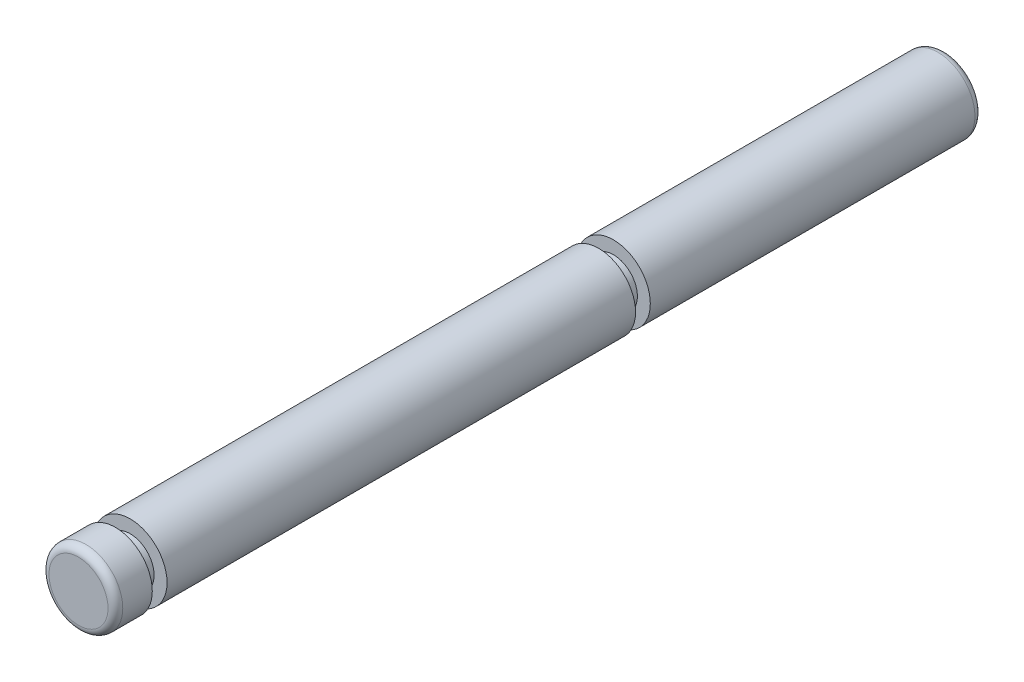
ISO-10303-21;
HEADER;
FILE_DESCRIPTION(('STEP AP214'),'2;1');
FILE_NAME('part.step','',(''),(''),'','','');
FILE_SCHEMA(('AUTOMOTIVE_DESIGN { 1 0 10303 214 1 1 1 1 }'));
ENDSEC;
DATA;
#1=APPLICATION_CONTEXT('core data for automotive mechanical design processes');
#2=APPLICATION_PROTOCOL_DEFINITION('international standard','automotive_design',2000,#1);
#3=PRODUCT_CONTEXT('',#1,'mechanical');
#4=PRODUCT('Part','Part','',(#3));
#5=PRODUCT_RELATED_PRODUCT_CATEGORY('part','',(#4));
#6=PRODUCT_DEFINITION_FORMATION('','',#4);
#7=PRODUCT_DEFINITION_CONTEXT('part definition',#1,'design');
#8=PRODUCT_DEFINITION('design','',#6,#7);
#9=PRODUCT_DEFINITION_SHAPE('','',#8);
#10=(LENGTH_UNIT() NAMED_UNIT(*) SI_UNIT(.MILLI.,.METRE.));
#11=(NAMED_UNIT(*) PLANE_ANGLE_UNIT() SI_UNIT($,.RADIAN.));
#12=(NAMED_UNIT(*) SI_UNIT($,.STERADIAN.) SOLID_ANGLE_UNIT());
#13=UNCERTAINTY_MEASURE_WITH_UNIT(LENGTH_MEASURE(1.E-05),#10,'distance_accuracy_value','');
#14=(GEOMETRIC_REPRESENTATION_CONTEXT(3) GLOBAL_UNCERTAINTY_ASSIGNED_CONTEXT((#13)) GLOBAL_UNIT_ASSIGNED_CONTEXT((#10,
#11,#12)) REPRESENTATION_CONTEXT('',''));
#15=CARTESIAN_POINT('',(0.,0.,0.));
#16=DIRECTION('',(0.,0.,1.));
#17=DIRECTION('',(1.,0.,0.));
#18=AXIS2_PLACEMENT_3D('',#15,#16,#17);
#19=CARTESIAN_POINT('',(0.,0.,0.));
#20=DIRECTION('',(0.,0.,1.));
#21=DIRECTION('',(1.,0.,0.));
#22=AXIS2_PLACEMENT_3D('',#19,#20,#21);
#23=PLANE('',#22);
#24=CARTESIAN_POINT('',(0.,0.,0.));
#25=DIRECTION('',(0.,0.,1.));
#26=DIRECTION('',(1.,0.,0.));
#27=AXIS2_PLACEMENT_3D('',#24,#25,#26);
#28=CIRCLE('',#27,0.8);
#29=CARTESIAN_POINT('',(0.8,0.,0.));
#30=VERTEX_POINT('',#29);
#31=EDGE_CURVE('E10',#30,#30,#28,.T.);
#32=ORIENTED_EDGE('',*,*,#31,.F.);
#33=EDGE_LOOP('',(#32));
#34=FACE_BOUND('',#33,.T.);
#35=ADVANCED_FACE('F30',(#34),#23,.F.);
#36=CARTESIAN_POINT('',(0.,0.,0.2));
#37=DIRECTION('',(0.,0.,1.));
#38=DIRECTION('',(1.,0.,0.));
#39=AXIS2_PLACEMENT_3D('',#36,#37,#38);
#40=TOROIDAL_SURFACE('',#39,0.8,0.2);
#41=CARTESIAN_POINT('',(0.,0.,0.199999999999999));
#42=DIRECTION('',(0.,0.,1.));
#43=DIRECTION('',(1.,0.,0.));
#44=AXIS2_PLACEMENT_3D('',#41,#42,#43);
#45=CIRCLE('',#44,1.);
#46=CARTESIAN_POINT('',(1.,0.,0.199999999999999));
#47=VERTEX_POINT('',#46);
#48=EDGE_CURVE('E36',#47,#47,#45,.T.);
#49=ORIENTED_EDGE('',*,*,#48,.F.);
#50=EDGE_LOOP('',(#49));
#51=FACE_BOUND('',#50,.T.);
#52=ORIENTED_EDGE('',*,*,#31,.T.);
#53=EDGE_LOOP('',(#52));
#54=FACE_BOUND('',#53,.T.);
#55=ADVANCED_FACE('F132',(#51,#54),#40,.T.);
#56=CARTESIAN_POINT('',(0.,0.,23.5));
#57=DIRECTION('',(0.,0.,1.));
#58=DIRECTION('',(1.,0.,0.));
#59=AXIS2_PLACEMENT_3D('',#56,#57,#58);
#60=CYLINDRICAL_SURFACE('',#59,1.);
#61=CARTESIAN_POINT('',(0.,0.,9.));
#62=DIRECTION('',(0.,0.,1.));
#63=DIRECTION('',(1.,0.,0.));
#64=AXIS2_PLACEMENT_3D('',#61,#62,#63);
#65=CIRCLE('',#64,0.999999999999999);
#66=CARTESIAN_POINT('',(0.999999999999999,0.,9.));
#67=VERTEX_POINT('',#66);
#68=EDGE_CURVE('E40',#67,#67,#65,.T.);
#69=ORIENTED_EDGE('',*,*,#68,.F.);
#70=EDGE_LOOP('',(#69));
#71=FACE_BOUND('',#70,.T.);
#72=ORIENTED_EDGE('',*,*,#48,.T.);
#73=EDGE_LOOP('',(#72));
#74=FACE_BOUND('',#73,.T.);
#75=ADVANCED_FACE('F127',(#71,#74),#60,.T.);
#76=CARTESIAN_POINT('',(0.,0.65,9.));
#77=DIRECTION('',(0.,0.,-1.));
#78=DIRECTION('',(-1.,0.,0.));
#79=AXIS2_PLACEMENT_3D('',#76,#77,#78);
#80=PLANE('',#79);
#81=CARTESIAN_POINT('',(0.,0.,9.));
#82=DIRECTION('',(0.,0.,1.));
#83=DIRECTION('',(1.,0.,0.));
#84=AXIS2_PLACEMENT_3D('',#81,#82,#83);
#85=CIRCLE('',#84,0.65);
#86=CARTESIAN_POINT('',(0.65,0.,9.));
#87=VERTEX_POINT('',#86);
#88=EDGE_CURVE('E44',#87,#87,#85,.T.);
#89=ORIENTED_EDGE('',*,*,#88,.F.);
#90=EDGE_LOOP('',(#89));
#91=FACE_BOUND('',#90,.T.);
#92=ORIENTED_EDGE('',*,*,#68,.T.);
#93=EDGE_LOOP('',(#92));
#94=FACE_BOUND('',#93,.T.);
#95=ADVANCED_FACE('F121',(#91,#94),#80,.F.);
#96=CARTESIAN_POINT('',(0.,0.,23.5));
#97=DIRECTION('',(0.,0.,1.));
#98=DIRECTION('',(1.,0.,0.));
#99=AXIS2_PLACEMENT_3D('',#96,#97,#98);
#100=CYLINDRICAL_SURFACE('',#99,0.65);
#101=CARTESIAN_POINT('',(0.,0.,9.4));
#102=DIRECTION('',(0.,0.,1.));
#103=DIRECTION('',(1.,0.,0.));
#104=AXIS2_PLACEMENT_3D('',#101,#102,#103);
#105=CIRCLE('',#104,0.65);
#106=CARTESIAN_POINT('',(0.65,0.,9.4));
#107=VERTEX_POINT('',#106);
#108=EDGE_CURVE('E49',#107,#107,#105,.T.);
#109=ORIENTED_EDGE('',*,*,#108,.F.);
#110=EDGE_LOOP('',(#109));
#111=FACE_BOUND('',#110,.T.);
#112=ORIENTED_EDGE('',*,*,#88,.T.);
#113=EDGE_LOOP('',(#112));
#114=FACE_BOUND('',#113,.T.);
#115=ADVANCED_FACE('F115',(#111,#114),#100,.T.);
#116=CARTESIAN_POINT('',(0.,0.999999999999999,9.4));
#117=DIRECTION('',(0.,0.,1.));
#118=DIRECTION('',(1.,0.,0.));
#119=AXIS2_PLACEMENT_3D('',#116,#117,#118);
#120=PLANE('',#119);
#121=CARTESIAN_POINT('',(0.,0.,9.4));
#122=DIRECTION('',(0.,0.,1.));
#123=DIRECTION('',(1.,0.,0.));
#124=AXIS2_PLACEMENT_3D('',#121,#122,#123);
#125=CIRCLE('',#124,0.999999999999999);
#126=CARTESIAN_POINT('',(0.999999999999999,0.,9.4));
#127=VERTEX_POINT('',#126);
#128=EDGE_CURVE('E52',#127,#127,#125,.T.);
#129=ORIENTED_EDGE('',*,*,#128,.F.);
#130=EDGE_LOOP('',(#129));
#131=FACE_BOUND('',#130,.T.);
#132=ORIENTED_EDGE('',*,*,#108,.T.);
#133=EDGE_LOOP('',(#132));
#134=FACE_BOUND('',#133,.T.);
#135=ADVANCED_FACE('F109',(#131,#134),#120,.F.);
#136=CARTESIAN_POINT('',(0.,0.,23.5));
#137=DIRECTION('',(0.,0.,1.));
#138=DIRECTION('',(1.,0.,0.));
#139=AXIS2_PLACEMENT_3D('',#136,#137,#138);
#140=CYLINDRICAL_SURFACE('',#139,0.999999999999998);
#141=CARTESIAN_POINT('',(0.,0.,22.1));
#142=DIRECTION('',(0.,0.,1.));
#143=DIRECTION('',(1.,0.,0.));
#144=AXIS2_PLACEMENT_3D('',#141,#142,#143);
#145=CIRCLE('',#144,0.999999999999997);
#146=CARTESIAN_POINT('',(0.999999999999997,0.,22.1));
#147=VERTEX_POINT('',#146);
#148=EDGE_CURVE('E55',#147,#147,#145,.T.);
#149=ORIENTED_EDGE('',*,*,#148,.F.);
#150=EDGE_LOOP('',(#149));
#151=FACE_BOUND('',#150,.T.);
#152=ORIENTED_EDGE('',*,*,#128,.T.);
#153=EDGE_LOOP('',(#152));
#154=FACE_BOUND('',#153,.T.);
#155=ADVANCED_FACE('F103',(#151,#154),#140,.T.);
#156=CARTESIAN_POINT('',(0.,0.999999999999997,22.1));
#157=DIRECTION('',(0.,0.,-1.));
#158=DIRECTION('',(-1.,0.,0.));
#159=AXIS2_PLACEMENT_3D('',#156,#157,#158);
#160=PLANE('',#159);
#161=CARTESIAN_POINT('',(0.,0.,22.1));
#162=DIRECTION('',(0.,0.,1.));
#163=DIRECTION('',(1.,0.,0.));
#164=AXIS2_PLACEMENT_3D('',#161,#162,#163);
#165=CIRCLE('',#164,0.65);
#166=CARTESIAN_POINT('',(0.65,0.,22.1));
#167=VERTEX_POINT('',#166);
#168=EDGE_CURVE('E58',#167,#167,#165,.T.);
#169=ORIENTED_EDGE('',*,*,#168,.F.);
#170=EDGE_LOOP('',(#169));
#171=FACE_BOUND('',#170,.T.);
#172=ORIENTED_EDGE('',*,*,#148,.T.);
#173=EDGE_LOOP('',(#172));
#174=FACE_BOUND('',#173,.T.);
#175=ADVANCED_FACE('F97',(#171,#174),#160,.F.);
#176=CARTESIAN_POINT('',(0.,0.,23.5));
#177=DIRECTION('',(0.,0.,1.));
#178=DIRECTION('',(1.,0.,0.));
#179=AXIS2_PLACEMENT_3D('',#176,#177,#178);
#180=CYLINDRICAL_SURFACE('',#179,0.65);
#181=CARTESIAN_POINT('',(0.,0.,22.5));
#182=DIRECTION('',(0.,0.,1.));
#183=DIRECTION('',(1.,0.,0.));
#184=AXIS2_PLACEMENT_3D('',#181,#182,#183);
#185=CIRCLE('',#184,0.65);
#186=CARTESIAN_POINT('',(0.65,0.,22.5));
#187=VERTEX_POINT('',#186);
#188=EDGE_CURVE('E61',#187,#187,#185,.T.);
#189=ORIENTED_EDGE('',*,*,#188,.F.);
#190=EDGE_LOOP('',(#189));
#191=FACE_BOUND('',#190,.T.);
#192=ORIENTED_EDGE('',*,*,#168,.T.);
#193=EDGE_LOOP('',(#192));
#194=FACE_BOUND('',#193,.T.);
#195=ADVANCED_FACE('F91',(#191,#194),#180,.T.);
#196=CARTESIAN_POINT('',(0.,0.999999999999997,22.5));
#197=DIRECTION('',(0.,0.,1.));
#198=DIRECTION('',(1.,0.,0.));
#199=AXIS2_PLACEMENT_3D('',#196,#197,#198);
#200=PLANE('',#199);
#201=CARTESIAN_POINT('',(0.,0.,22.5));
#202=DIRECTION('',(0.,0.,1.));
#203=DIRECTION('',(1.,0.,0.));
#204=AXIS2_PLACEMENT_3D('',#201,#202,#203);
#205=CIRCLE('',#204,0.999999999999997);
#206=CARTESIAN_POINT('',(0.999999999999997,0.,22.5));
#207=VERTEX_POINT('',#206);
#208=EDGE_CURVE('E64',#207,#207,#205,.T.);
#209=ORIENTED_EDGE('',*,*,#208,.F.);
#210=EDGE_LOOP('',(#209));
#211=FACE_BOUND('',#210,.T.);
#212=ORIENTED_EDGE('',*,*,#188,.T.);
#213=EDGE_LOOP('',(#212));
#214=FACE_BOUND('',#213,.T.);
#215=ADVANCED_FACE('F85',(#211,#214),#200,.F.);
#216=CARTESIAN_POINT('',(0.,0.,23.5));
#217=DIRECTION('',(0.,0.,1.));
#218=DIRECTION('',(1.,0.,0.));
#219=AXIS2_PLACEMENT_3D('',#216,#217,#218);
#220=CYLINDRICAL_SURFACE('',#219,0.999999999999997);
#221=CARTESIAN_POINT('',(0.,0.,23.3));
#222=DIRECTION('',(0.,0.,1.));
#223=DIRECTION('',(1.,0.,0.));
#224=AXIS2_PLACEMENT_3D('',#221,#222,#223);
#225=CIRCLE('',#224,0.999999999999997);
#226=CARTESIAN_POINT('',(0.999999999999997,0.,23.3));
#227=VERTEX_POINT('',#226);
#228=EDGE_CURVE('E67',#227,#227,#225,.T.);
#229=ORIENTED_EDGE('',*,*,#228,.F.);
#230=EDGE_LOOP('',(#229));
#231=FACE_BOUND('',#230,.T.);
#232=ORIENTED_EDGE('',*,*,#208,.T.);
#233=EDGE_LOOP('',(#232));
#234=FACE_BOUND('',#233,.T.);
#235=ADVANCED_FACE('F79',(#231,#234),#220,.T.);
#236=CARTESIAN_POINT('',(0.,0.,23.3));
#237=DIRECTION('',(0.,0.,1.));
#238=DIRECTION('',(1.,0.,0.));
#239=AXIS2_PLACEMENT_3D('',#236,#237,#238);
#240=TOROIDAL_SURFACE('',#239,0.799999999999997,0.199999999999999);
#241=CARTESIAN_POINT('',(0.,0.,23.5));
#242=DIRECTION('',(0.,0.,1.));
#243=DIRECTION('',(1.,0.,0.));
#244=AXIS2_PLACEMENT_3D('',#241,#242,#243);
#245=CIRCLE('',#244,0.799999999999997);
#246=CARTESIAN_POINT('',(0.799999999999997,0.,23.5));
#247=VERTEX_POINT('',#246);
#248=EDGE_CURVE('E70',#247,#247,#245,.T.);
#249=ORIENTED_EDGE('',*,*,#248,.F.);
#250=EDGE_LOOP('',(#249));
#251=FACE_BOUND('',#250,.T.);
#252=ORIENTED_EDGE('',*,*,#228,.T.);
#253=EDGE_LOOP('',(#252));
#254=FACE_BOUND('',#253,.T.);
#255=ADVANCED_FACE('F76',(#251,#254),#240,.T.);
#256=CARTESIAN_POINT('',(0.,0.799999999999997,23.5));
#257=DIRECTION('',(0.,0.,-1.));
#258=DIRECTION('',(-1.,0.,0.));
#259=AXIS2_PLACEMENT_3D('',#256,#257,#258);
#260=PLANE('',#259);
#261=ORIENTED_EDGE('',*,*,#248,.T.);
#262=EDGE_LOOP('',(#261));
#263=FACE_BOUND('',#262,.T.);
#264=ADVANCED_FACE('F74',(#263),#260,.F.);
#265=CLOSED_SHELL('',(#35,#55,#75,#95,#115,#135,#155,#175,#195,#215,#235,#255,#264));
#266=MANIFOLD_SOLID_BREP('B2',#265);
#267=ADVANCED_BREP_SHAPE_REPRESENTATION('',(#18,#266),#14);
#268=SHAPE_DEFINITION_REPRESENTATION(#9,#267);
ENDSEC;
END-ISO-10303-21;
